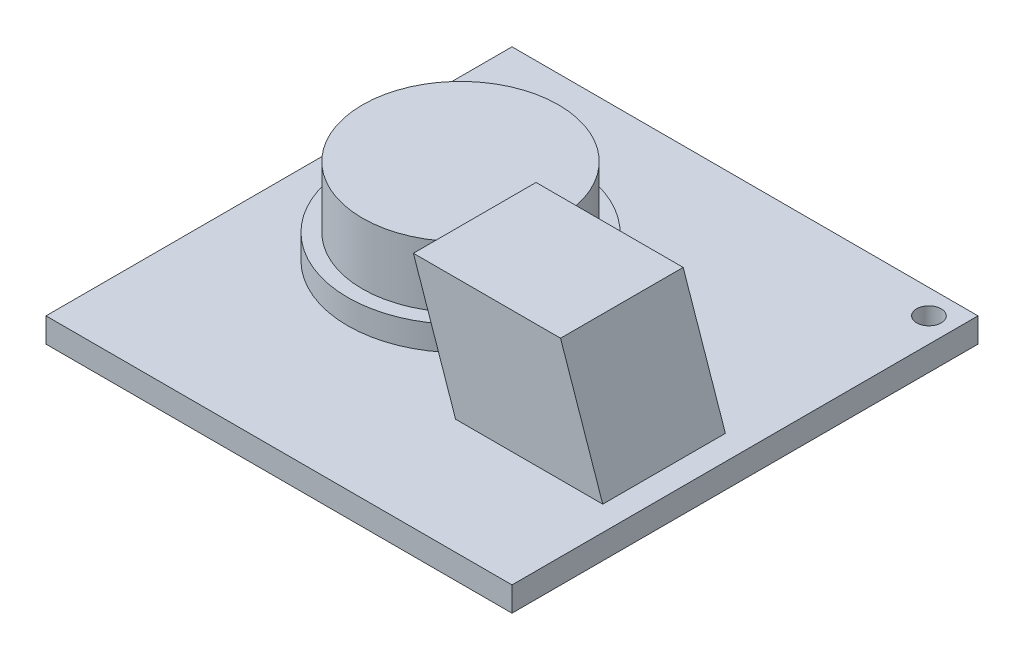
ISO-10303-21;
HEADER;
FILE_DESCRIPTION(('STEP AP214'),'2;1');
FILE_NAME('part.step','',(''),(''),'','','');
FILE_SCHEMA(('AUTOMOTIVE_DESIGN { 1 0 10303 214 1 1 1 1 }'));
ENDSEC;
DATA;
#1=APPLICATION_CONTEXT('core data for automotive mechanical design processes');
#2=APPLICATION_PROTOCOL_DEFINITION('international standard','automotive_design',2000,#1);
#3=PRODUCT_CONTEXT('',#1,'mechanical');
#4=PRODUCT('Part','Part','',(#3));
#5=PRODUCT_RELATED_PRODUCT_CATEGORY('part','',(#4));
#6=PRODUCT_DEFINITION_FORMATION('','',#4);
#7=PRODUCT_DEFINITION_CONTEXT('part definition',#1,'design');
#8=PRODUCT_DEFINITION('design','',#6,#7);
#9=PRODUCT_DEFINITION_SHAPE('','',#8);
#10=(LENGTH_UNIT() NAMED_UNIT(*) SI_UNIT(.MILLI.,.METRE.));
#11=(NAMED_UNIT(*) PLANE_ANGLE_UNIT() SI_UNIT($,.RADIAN.));
#12=(NAMED_UNIT(*) SI_UNIT($,.STERADIAN.) SOLID_ANGLE_UNIT());
#13=UNCERTAINTY_MEASURE_WITH_UNIT(LENGTH_MEASURE(1.E-05),#10,'distance_accuracy_value','');
#14=(GEOMETRIC_REPRESENTATION_CONTEXT(3) GLOBAL_UNCERTAINTY_ASSIGNED_CONTEXT((#13)) GLOBAL_UNIT_ASSIGNED_CONTEXT((#10,
#11,#12)) REPRESENTATION_CONTEXT('',''));
#15=CARTESIAN_POINT('',(0.,0.,0.));
#16=DIRECTION('',(0.,0.,1.));
#17=DIRECTION('',(1.,0.,0.));
#18=AXIS2_PLACEMENT_3D('',#15,#16,#17);
#19=CARTESIAN_POINT('',(-29.5691278322806,2.,16.1071778364747));
#20=DIRECTION('',(0.,1.,0.));
#21=DIRECTION('',(0.,0.,1.));
#22=AXIS2_PLACEMENT_3D('',#19,#20,#21);
#23=PLANE('',#22);
#24=CARTESIAN_POINT('',(-29.5691278322806,2.,16.1071778364747));
#25=DIRECTION('',(0.,1.,0.));
#26=DIRECTION('',(0.,0.,1.));
#27=AXIS2_PLACEMENT_3D('',#24,#25,#26);
#28=CIRCLE('',#27,4.6);
#29=CARTESIAN_POINT('',(-29.5691278322806,2.,20.7071778364747));
#30=VERTEX_POINT('',#29);
#31=EDGE_CURVE('E133',#30,#30,#28,.T.);
#32=ORIENTED_EDGE('',*,*,#31,.T.);
#33=EDGE_LOOP('',(#32));
#34=FACE_BOUND('',#33,.T.);
#35=CARTESIAN_POINT('',(-29.5691278322806,2.,16.1071778364747));
#36=DIRECTION('',(0.,1.,0.));
#37=DIRECTION('',(0.,0.,1.));
#38=AXIS2_PLACEMENT_3D('',#35,#36,#37);
#39=CIRCLE('',#38,4.);
#40=CARTESIAN_POINT('',(-29.5691278322806,2.,20.1071778364747));
#41=VERTEX_POINT('',#40);
#42=EDGE_CURVE('E121',#41,#41,#39,.T.);
#43=ORIENTED_EDGE('',*,*,#42,.F.);
#44=EDGE_LOOP('',(#43));
#45=FACE_BOUND('',#44,.T.);
#46=ADVANCED_FACE('F35',(#34,#45),#23,.T.);
#47=CARTESIAN_POINT('',(0.,1.,0.));
#48=DIRECTION('',(0.,1.,0.));
#49=DIRECTION('',(0.,0.,1.));
#50=AXIS2_PLACEMENT_3D('',#47,#48,#49);
#51=PLANE('',#50);
#52=DIRECTION('',(0.,0.,1.));
#53=VECTOR('',#52,1.);
#54=CARTESIAN_POINT('',(-24.0691278322806,1.,16.8071778364747));
#55=LINE('',#54,#53);
#56=CARTESIAN_POINT('',(-24.0691278322806,1.,16.8071778364747));
#57=VERTEX_POINT('',#56);
#58=CARTESIAN_POINT('',(-24.0691278322806,1.,21.8071778364747));
#59=VERTEX_POINT('',#58);
#60=EDGE_CURVE('E120',#57,#59,#55,.T.);
#61=ORIENTED_EDGE('',*,*,#60,.F.);
#62=DIRECTION('',(-1.,0.,0.));
#63=VECTOR('',#62,1.);
#64=CARTESIAN_POINT('',(-24.0691278322806,1.,16.8071778364747));
#65=LINE('',#64,#63);
#66=CARTESIAN_POINT('',(-18.0691278322806,1.,16.8071778364747));
#67=VERTEX_POINT('',#66);
#68=EDGE_CURVE('E50',#67,#57,#65,.T.);
#69=ORIENTED_EDGE('',*,*,#68,.F.);
#70=DIRECTION('',(0.,0.,-1.));
#71=VECTOR('',#70,1.);
#72=CARTESIAN_POINT('',(-18.0691278322806,1.,16.8071778364747));
#73=LINE('',#72,#71);
#74=CARTESIAN_POINT('',(-18.0691278322806,1.,21.8071778364747));
#75=VERTEX_POINT('',#74);
#76=EDGE_CURVE('E334',#75,#67,#73,.T.);
#77=ORIENTED_EDGE('',*,*,#76,.F.);
#78=DIRECTION('',(1.,0.,0.));
#79=VECTOR('',#78,1.);
#80=CARTESIAN_POINT('',(-24.0691278322806,1.,21.8071778364747));
#81=LINE('',#80,#79);
#82=EDGE_CURVE('E55',#59,#75,#81,.T.);
#83=ORIENTED_EDGE('',*,*,#82,.F.);
#84=EDGE_LOOP('',(#61,#69,#77,#83));
#85=FACE_BOUND('',#84,.T.);
#86=DIRECTION('',(0.,0.,1.));
#87=VECTOR('',#86,1.);
#88=CARTESIAN_POINT('',(-36.0691278322806,1.,7.50717783647467));
#89=LINE('',#88,#87);
#90=CARTESIAN_POINT('',(-36.0691278322806,1.,7.50717783647467));
#91=VERTEX_POINT('',#90);
#92=CARTESIAN_POINT('',(-36.0691278322806,1.,26.5071778364747));
#93=VERTEX_POINT('',#92);
#94=EDGE_CURVE('E145',#91,#93,#89,.T.);
#95=ORIENTED_EDGE('',*,*,#94,.T.);
#96=DIRECTION('',(1.,0.,0.));
#97=VECTOR('',#96,1.);
#98=CARTESIAN_POINT('',(-36.0691278322806,1.,26.5071778364747));
#99=LINE('',#98,#97);
#100=CARTESIAN_POINT('',(-17.0691278322806,1.,26.5071778364747));
#101=VERTEX_POINT('',#100);
#102=EDGE_CURVE('E148',#93,#101,#99,.T.);
#103=ORIENTED_EDGE('',*,*,#102,.T.);
#104=DIRECTION('',(0.,0.,-1.));
#105=VECTOR('',#104,1.);
#106=CARTESIAN_POINT('',(-17.0691278322806,1.,7.50717783647467));
#107=LINE('',#106,#105);
#108=CARTESIAN_POINT('',(-17.0691278322806,1.,7.50717783647467));
#109=VERTEX_POINT('',#108);
#110=EDGE_CURVE('E151',#101,#109,#107,.T.);
#111=ORIENTED_EDGE('',*,*,#110,.T.);
#112=DIRECTION('',(-1.,0.,0.));
#113=VECTOR('',#112,1.);
#114=CARTESIAN_POINT('',(-36.0691278322806,1.,7.50717783647467));
#115=LINE('',#114,#113);
#116=EDGE_CURVE('E153',#109,#91,#115,.T.);
#117=ORIENTED_EDGE('',*,*,#116,.T.);
#118=EDGE_LOOP('',(#95,#103,#111,#117));
#119=FACE_BOUND('',#118,.T.);
#120=CARTESIAN_POINT('',(-18.0691278322806,1.,8.50717783647467));
#121=DIRECTION('',(0.,1.,0.));
#122=DIRECTION('',(0.,0.,1.));
#123=AXIS2_PLACEMENT_3D('',#120,#121,#122);
#124=CIRCLE('',#123,0.499999999999999);
#125=CARTESIAN_POINT('',(-18.0691278322806,1.,9.00717783647467));
#126=VERTEX_POINT('',#125);
#127=EDGE_CURVE('E136',#126,#126,#124,.T.);
#128=ORIENTED_EDGE('',*,*,#127,.F.);
#129=EDGE_LOOP('',(#128));
#130=FACE_BOUND('',#129,.T.);
#131=CARTESIAN_POINT('',(-29.5691278322806,1.,16.1071778364747));
#132=DIRECTION('',(0.,1.,0.));
#133=DIRECTION('',(0.,0.,1.));
#134=AXIS2_PLACEMENT_3D('',#131,#132,#133);
#135=CIRCLE('',#134,4.6);
#136=CARTESIAN_POINT('',(-29.5691278322806,1.,20.7071778364747));
#137=VERTEX_POINT('',#136);
#138=EDGE_CURVE('E131',#137,#137,#135,.T.);
#139=ORIENTED_EDGE('',*,*,#138,.F.);
#140=EDGE_LOOP('',(#139));
#141=FACE_BOUND('',#140,.T.);
#142=ADVANCED_FACE('F187',(#85,#119,#130,#141),#51,.T.);
#143=CARTESIAN_POINT('',(-36.0691278322806,1.,7.50717783647467));
#144=DIRECTION('',(1.,0.,0.));
#145=DIRECTION('',(0.,0.,-1.));
#146=AXIS2_PLACEMENT_3D('',#143,#144,#145);
#147=PLANE('',#146);
#148=DIRECTION('',(0.,0.,1.));
#149=VECTOR('',#148,1.);
#150=CARTESIAN_POINT('',(-36.0691278322806,0.,7.50717783647467));
#151=LINE('',#150,#149);
#152=CARTESIAN_POINT('',(-36.0691278322806,0.,7.50717783647467));
#153=VERTEX_POINT('',#152);
#154=CARTESIAN_POINT('',(-36.0691278322806,0.,26.5071778364747));
#155=VERTEX_POINT('',#154);
#156=EDGE_CURVE('E142',#153,#155,#151,.T.);
#157=ORIENTED_EDGE('',*,*,#156,.T.);
#158=DIRECTION('',(0.,-1.,0.));
#159=VECTOR('',#158,1.);
#160=CARTESIAN_POINT('',(-36.0691278322806,1.,26.5071778364747));
#161=LINE('',#160,#159);
#162=EDGE_CURVE('E11',#93,#155,#161,.T.);
#163=ORIENTED_EDGE('',*,*,#162,.F.);
#164=ORIENTED_EDGE('',*,*,#94,.F.);
#165=DIRECTION('',(0.,-1.,0.));
#166=VECTOR('',#165,1.);
#167=CARTESIAN_POINT('',(-36.0691278322806,1.,7.50717783647467));
#168=LINE('',#167,#166);
#169=EDGE_CURVE('E155',#91,#153,#168,.T.);
#170=ORIENTED_EDGE('',*,*,#169,.T.);
#171=EDGE_LOOP('',(#157,#163,#164,#170));
#172=FACE_BOUND('',#171,.T.);
#173=ADVANCED_FACE('F37',(#172),#147,.F.);
#174=CARTESIAN_POINT('',(-36.0691278322806,1.,26.5071778364747));
#175=DIRECTION('',(0.,0.,-1.));
#176=DIRECTION('',(-1.,0.,0.));
#177=AXIS2_PLACEMENT_3D('',#174,#175,#176);
#178=PLANE('',#177);
#179=DIRECTION('',(1.,0.,0.));
#180=VECTOR('',#179,1.);
#181=CARTESIAN_POINT('',(-36.0691278322806,0.,26.5071778364747));
#182=LINE('',#181,#180);
#183=CARTESIAN_POINT('',(-17.0691278322806,0.,26.5071778364747));
#184=VERTEX_POINT('',#183);
#185=EDGE_CURVE('E158',#155,#184,#182,.T.);
#186=ORIENTED_EDGE('',*,*,#185,.T.);
#187=DIRECTION('',(0.,-1.,0.));
#188=VECTOR('',#187,1.);
#189=CARTESIAN_POINT('',(-17.0691278322806,1.,26.5071778364747));
#190=LINE('',#189,#188);
#191=EDGE_CURVE('E43',#101,#184,#190,.T.);
#192=ORIENTED_EDGE('',*,*,#191,.F.);
#193=ORIENTED_EDGE('',*,*,#102,.F.);
#194=ORIENTED_EDGE('',*,*,#162,.T.);
#195=EDGE_LOOP('',(#186,#192,#193,#194));
#196=FACE_BOUND('',#195,.T.);
#197=ADVANCED_FACE('F189',(#196),#178,.F.);
#198=CARTESIAN_POINT('',(-17.0691278322806,1.,7.50717783647467));
#199=DIRECTION('',(-1.,0.,0.));
#200=DIRECTION('',(0.,0.,1.));
#201=AXIS2_PLACEMENT_3D('',#198,#199,#200);
#202=PLANE('',#201);
#203=DIRECTION('',(0.,0.,-1.));
#204=VECTOR('',#203,1.);
#205=CARTESIAN_POINT('',(-17.0691278322806,0.,7.50717783647467));
#206=LINE('',#205,#204);
#207=CARTESIAN_POINT('',(-17.0691278322806,0.,7.50717783647467));
#208=VERTEX_POINT('',#207);
#209=EDGE_CURVE('E160',#184,#208,#206,.T.);
#210=ORIENTED_EDGE('',*,*,#209,.T.);
#211=DIRECTION('',(0.,-1.,0.));
#212=VECTOR('',#211,1.);
#213=CARTESIAN_POINT('',(-17.0691278322806,1.,7.50717783647467));
#214=LINE('',#213,#212);
#215=EDGE_CURVE('E165',#109,#208,#214,.T.);
#216=ORIENTED_EDGE('',*,*,#215,.F.);
#217=ORIENTED_EDGE('',*,*,#110,.F.);
#218=ORIENTED_EDGE('',*,*,#191,.T.);
#219=EDGE_LOOP('',(#210,#216,#217,#218));
#220=FACE_BOUND('',#219,.T.);
#221=ADVANCED_FACE('F172',(#220),#202,.F.);
#222=CARTESIAN_POINT('',(-36.0691278322806,1.,7.50717783647467));
#223=DIRECTION('',(0.,0.,1.));
#224=DIRECTION('',(1.,0.,0.));
#225=AXIS2_PLACEMENT_3D('',#222,#223,#224);
#226=PLANE('',#225);
#227=DIRECTION('',(-1.,0.,0.));
#228=VECTOR('',#227,1.);
#229=CARTESIAN_POINT('',(-36.0691278322806,0.,7.50717783647467));
#230=LINE('',#229,#228);
#231=EDGE_CURVE('E149',#208,#153,#230,.T.);
#232=ORIENTED_EDGE('',*,*,#231,.T.);
#233=ORIENTED_EDGE('',*,*,#169,.F.);
#234=ORIENTED_EDGE('',*,*,#116,.F.);
#235=ORIENTED_EDGE('',*,*,#215,.T.);
#236=EDGE_LOOP('',(#232,#233,#234,#235));
#237=FACE_BOUND('',#236,.T.);
#238=ADVANCED_FACE('F181',(#237),#226,.F.);
#239=CARTESIAN_POINT('',(0.,0.,0.));
#240=DIRECTION('',(0.,1.,0.));
#241=DIRECTION('',(0.,0.,1.));
#242=AXIS2_PLACEMENT_3D('',#239,#240,#241);
#243=PLANE('',#242);
#244=CARTESIAN_POINT('',(-18.0691278322806,0.,8.50717783647467));
#245=DIRECTION('',(0.,1.,0.));
#246=DIRECTION('',(0.,0.,1.));
#247=AXIS2_PLACEMENT_3D('',#244,#245,#246);
#248=CIRCLE('',#247,0.499999999999999);
#249=CARTESIAN_POINT('',(-18.0691278322806,0.,9.00717783647467));
#250=VERTEX_POINT('',#249);
#251=EDGE_CURVE('E139',#250,#250,#248,.T.);
#252=ORIENTED_EDGE('',*,*,#251,.T.);
#253=EDGE_LOOP('',(#252));
#254=FACE_BOUND('',#253,.T.);
#255=ORIENTED_EDGE('',*,*,#156,.F.);
#256=ORIENTED_EDGE('',*,*,#231,.F.);
#257=ORIENTED_EDGE('',*,*,#209,.F.);
#258=ORIENTED_EDGE('',*,*,#185,.F.);
#259=EDGE_LOOP('',(#255,#256,#257,#258));
#260=FACE_BOUND('',#259,.T.);
#261=ADVANCED_FACE('F178',(#254,#260),#243,.F.);
#262=CARTESIAN_POINT('',(-18.0691278322806,0.,8.50717783647467));
#263=DIRECTION('',(0.,1.,0.));
#264=DIRECTION('',(0.,0.,1.));
#265=AXIS2_PLACEMENT_3D('',#262,#263,#264);
#266=CYLINDRICAL_SURFACE('',#265,0.499999999999999);
#267=ORIENTED_EDGE('',*,*,#251,.F.);
#268=EDGE_LOOP('',(#267));
#269=FACE_BOUND('',#268,.T.);
#270=ORIENTED_EDGE('',*,*,#127,.T.);
#271=EDGE_LOOP('',(#270));
#272=FACE_BOUND('',#271,.T.);
#273=ADVANCED_FACE('F211',(#269,#272),#266,.F.);
#274=CARTESIAN_POINT('',(-29.5691278322806,2.,16.1071778364747));
#275=DIRECTION('',(0.,-1.,0.));
#276=DIRECTION('',(0.,0.,-1.));
#277=AXIS2_PLACEMENT_3D('',#274,#275,#276);
#278=CYLINDRICAL_SURFACE('',#277,4.6);
#279=ORIENTED_EDGE('',*,*,#31,.F.);
#280=EDGE_LOOP('',(#279));
#281=FACE_BOUND('',#280,.T.);
#282=ORIENTED_EDGE('',*,*,#138,.T.);
#283=EDGE_LOOP('',(#282));
#284=FACE_BOUND('',#283,.T.);
#285=ADVANCED_FACE('F208',(#281,#284),#278,.T.);
#286=CARTESIAN_POINT('',(-29.5691278322806,4.5,16.1071778364747));
#287=DIRECTION('',(0.,-1.,0.));
#288=DIRECTION('',(0.,0.,-1.));
#289=AXIS2_PLACEMENT_3D('',#286,#287,#288);
#290=CYLINDRICAL_SURFACE('',#289,4.);
#291=CARTESIAN_POINT('',(-29.5691278322806,4.5,16.1071778364747));
#292=DIRECTION('',(0.,1.,0.));
#293=DIRECTION('',(0.,0.,1.));
#294=AXIS2_PLACEMENT_3D('',#291,#292,#293);
#295=CIRCLE('',#294,4.);
#296=CARTESIAN_POINT('',(-29.5691278322806,4.5,20.1071778364747));
#297=VERTEX_POINT('',#296);
#298=EDGE_CURVE('E124',#297,#297,#295,.T.);
#299=ORIENTED_EDGE('',*,*,#298,.F.);
#300=EDGE_LOOP('',(#299));
#301=FACE_BOUND('',#300,.T.);
#302=ORIENTED_EDGE('',*,*,#42,.T.);
#303=EDGE_LOOP('',(#302));
#304=FACE_BOUND('',#303,.T.);
#305=ADVANCED_FACE('F206',(#301,#304),#290,.T.);
#306=CARTESIAN_POINT('',(-29.5691278322806,4.5,16.1071778364747));
#307=DIRECTION('',(0.,1.,0.));
#308=DIRECTION('',(0.,0.,1.));
#309=AXIS2_PLACEMENT_3D('',#306,#307,#308);
#310=PLANE('',#309);
#311=ORIENTED_EDGE('',*,*,#298,.T.);
#312=EDGE_LOOP('',(#311));
#313=FACE_BOUND('',#312,.T.);
#314=ADVANCED_FACE('F242',(#313),#310,.T.);
#315=CARTESIAN_POINT('',(-25.7896001468334,6.,16.8071778364747));
#316=DIRECTION('',(0.945586420600905,0.325371051532197,0.));
#317=DIRECTION('',(-0.325371051532197,0.945586420600905,0.));
#318=AXIS2_PLACEMENT_3D('',#315,#316,#317);
#319=PLANE('',#318);
#320=ORIENTED_EDGE('',*,*,#60,.T.);
#321=DIRECTION('',(0.325371051532197,-0.945586420600905,0.));
#322=VECTOR('',#321,1.);
#323=CARTESIAN_POINT('',(-25.7896001468334,6.,21.8071778364747));
#324=LINE('',#323,#322);
#325=CARTESIAN_POINT('',(-25.7896001468334,6.,21.8071778364747));
#326=VERTEX_POINT('',#325);
#327=EDGE_CURVE('E102',#326,#59,#324,.T.);
#328=ORIENTED_EDGE('',*,*,#327,.F.);
#329=DIRECTION('',(0.,0.,1.));
#330=VECTOR('',#329,1.);
#331=CARTESIAN_POINT('',(-25.7896001468334,6.,16.8071778364747));
#332=LINE('',#331,#330);
#333=CARTESIAN_POINT('',(-25.7896001468334,6.,16.8071778364747));
#334=VERTEX_POINT('',#333);
#335=EDGE_CURVE('E109',#334,#326,#332,.T.);
#336=ORIENTED_EDGE('',*,*,#335,.F.);
#337=DIRECTION('',(0.325371051532197,-0.945586420600905,0.));
#338=VECTOR('',#337,1.);
#339=CARTESIAN_POINT('',(-25.7896001468334,6.,16.8071778364747));
#340=LINE('',#339,#338);
#341=EDGE_CURVE('E332',#334,#57,#340,.T.);
#342=ORIENTED_EDGE('',*,*,#341,.T.);
#343=EDGE_LOOP('',(#320,#328,#336,#342));
#344=FACE_BOUND('',#343,.T.);
#345=ADVANCED_FACE('F119',(#344),#319,.F.);
#346=CARTESIAN_POINT('',(-25.7896001468334,6.,21.8071778364747));
#347=DIRECTION('',(0.,0.,-1.));
#348=DIRECTION('',(-1.,0.,0.));
#349=AXIS2_PLACEMENT_3D('',#346,#347,#348);
#350=PLANE('',#349);
#351=ORIENTED_EDGE('',*,*,#82,.T.);
#352=DIRECTION('',(0.325371051532197,-0.945586420600905,0.));
#353=VECTOR('',#352,1.);
#354=CARTESIAN_POINT('',(-19.7896001468334,6.,21.8071778364747));
#355=LINE('',#354,#353);
#356=CARTESIAN_POINT('',(-19.7896001468334,6.,21.8071778364747));
#357=VERTEX_POINT('',#356);
#358=EDGE_CURVE('E105',#357,#75,#355,.T.);
#359=ORIENTED_EDGE('',*,*,#358,.F.);
#360=DIRECTION('',(1.,0.,0.));
#361=VECTOR('',#360,1.);
#362=CARTESIAN_POINT('',(-25.7896001468334,6.,21.8071778364747));
#363=LINE('',#362,#361);
#364=EDGE_CURVE('E98',#326,#357,#363,.T.);
#365=ORIENTED_EDGE('',*,*,#364,.F.);
#366=ORIENTED_EDGE('',*,*,#327,.T.);
#367=EDGE_LOOP('',(#351,#359,#365,#366));
#368=FACE_BOUND('',#367,.T.);
#369=ADVANCED_FACE('F100',(#368),#350,.F.);
#370=CARTESIAN_POINT('',(-19.7896001468334,6.,16.8071778364747));
#371=DIRECTION('',(-0.945586420600905,-0.325371051532197,0.));
#372=DIRECTION('',(0.325371051532197,-0.945586420600905,0.));
#373=AXIS2_PLACEMENT_3D('',#370,#371,#372);
#374=PLANE('',#373);
#375=ORIENTED_EDGE('',*,*,#76,.T.);
#376=DIRECTION('',(0.325371051532197,-0.945586420600905,0.));
#377=VECTOR('',#376,1.);
#378=CARTESIAN_POINT('',(-19.7896001468334,6.,16.8071778364747));
#379=LINE('',#378,#377);
#380=CARTESIAN_POINT('',(-19.7896001468334,6.,16.8071778364747));
#381=VERTEX_POINT('',#380);
#382=EDGE_CURVE('E126',#381,#67,#379,.T.);
#383=ORIENTED_EDGE('',*,*,#382,.F.);
#384=DIRECTION('',(0.,0.,-1.));
#385=VECTOR('',#384,1.);
#386=CARTESIAN_POINT('',(-19.7896001468334,6.,16.8071778364747));
#387=LINE('',#386,#385);
#388=EDGE_CURVE('E108',#357,#381,#387,.T.);
#389=ORIENTED_EDGE('',*,*,#388,.F.);
#390=ORIENTED_EDGE('',*,*,#358,.T.);
#391=EDGE_LOOP('',(#375,#383,#389,#390));
#392=FACE_BOUND('',#391,.T.);
#393=ADVANCED_FACE('F262',(#392),#374,.F.);
#394=CARTESIAN_POINT('',(-25.7896001468334,6.,16.8071778364747));
#395=DIRECTION('',(0.,0.,1.));
#396=DIRECTION('',(1.,0.,0.));
#397=AXIS2_PLACEMENT_3D('',#394,#395,#396);
#398=PLANE('',#397);
#399=ORIENTED_EDGE('',*,*,#68,.T.);
#400=ORIENTED_EDGE('',*,*,#341,.F.);
#401=DIRECTION('',(-1.,0.,0.));
#402=VECTOR('',#401,1.);
#403=CARTESIAN_POINT('',(-25.7896001468334,6.,16.8071778364747));
#404=LINE('',#403,#402);
#405=EDGE_CURVE('E114',#381,#334,#404,.T.);
#406=ORIENTED_EDGE('',*,*,#405,.F.);
#407=ORIENTED_EDGE('',*,*,#382,.T.);
#408=EDGE_LOOP('',(#399,#400,#406,#407));
#409=FACE_BOUND('',#408,.T.);
#410=ADVANCED_FACE('F269',(#409),#398,.F.);
#411=CARTESIAN_POINT('',(-1.72047231455285,6.,0.));
#412=DIRECTION('',(0.,1.,0.));
#413=DIRECTION('',(0.,0.,1.));
#414=AXIS2_PLACEMENT_3D('',#411,#412,#413);
#415=PLANE('',#414);
#416=ORIENTED_EDGE('',*,*,#335,.T.);
#417=ORIENTED_EDGE('',*,*,#364,.T.);
#418=ORIENTED_EDGE('',*,*,#388,.T.);
#419=ORIENTED_EDGE('',*,*,#405,.T.);
#420=EDGE_LOOP('',(#416,#417,#418,#419));
#421=FACE_BOUND('',#420,.T.);
#422=ADVANCED_FACE('F112',(#421),#415,.T.);
#423=CLOSED_SHELL('',(#46,#142,#173,#197,#221,#238,#261,#273,#285,#305,#314,#345,#369,#393,#410,#422));
#424=MANIFOLD_SOLID_BREP('B2',#423);
#425=ADVANCED_BREP_SHAPE_REPRESENTATION('',(#18,#424),#14);
#426=SHAPE_DEFINITION_REPRESENTATION(#9,#425);
ENDSEC;
END-ISO-10303-21;
